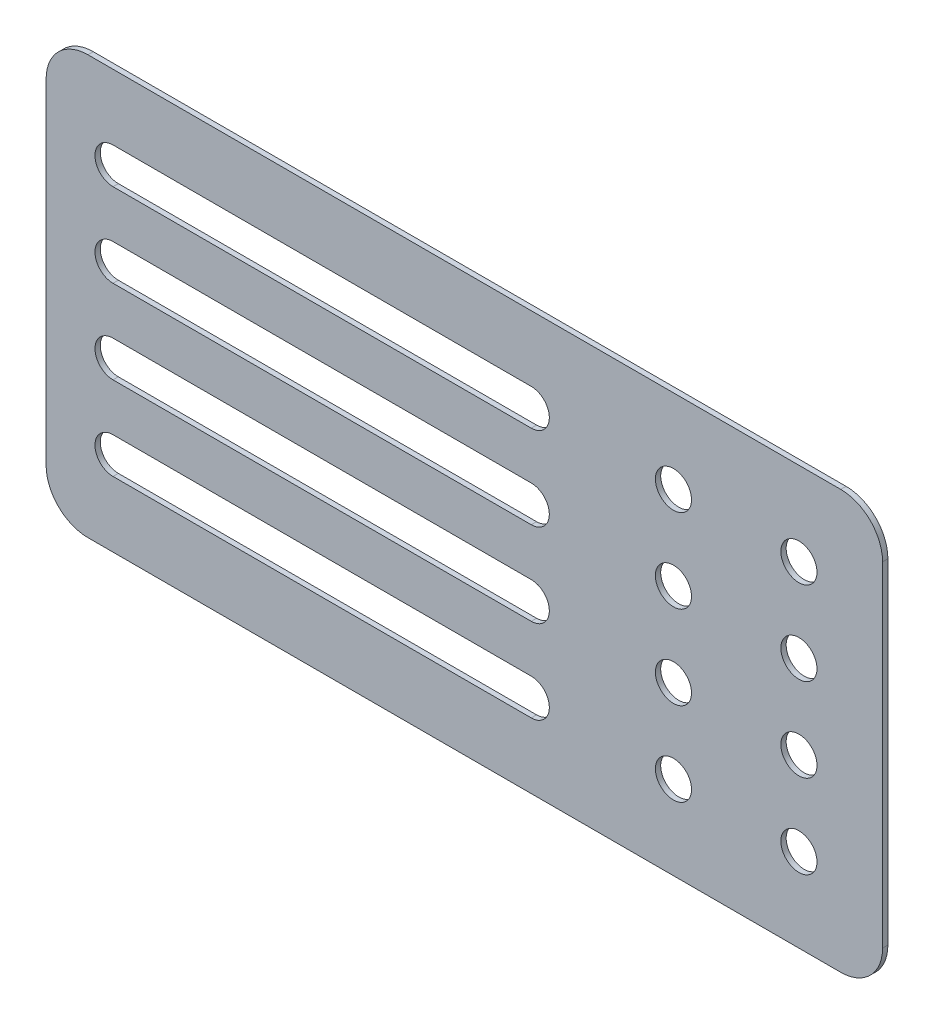
ISO-10303-21;
HEADER;
FILE_DESCRIPTION(('STEP AP214'),'2;1');
FILE_NAME('part.step','',(''),(''),'','','');
FILE_SCHEMA(('AUTOMOTIVE_DESIGN { 1 0 10303 214 1 1 1 1 }'));
ENDSEC;
DATA;
#1=APPLICATION_CONTEXT('core data for automotive mechanical design processes');
#2=APPLICATION_PROTOCOL_DEFINITION('international standard','automotive_design',2000,#1);
#3=PRODUCT_CONTEXT('',#1,'mechanical');
#4=PRODUCT('Part','Part','',(#3));
#5=PRODUCT_RELATED_PRODUCT_CATEGORY('part','',(#4));
#6=PRODUCT_DEFINITION_FORMATION('','',#4);
#7=PRODUCT_DEFINITION_CONTEXT('part definition',#1,'design');
#8=PRODUCT_DEFINITION('design','',#6,#7);
#9=PRODUCT_DEFINITION_SHAPE('','',#8);
#10=(LENGTH_UNIT() NAMED_UNIT(*) SI_UNIT(.MILLI.,.METRE.));
#11=(NAMED_UNIT(*) PLANE_ANGLE_UNIT() SI_UNIT($,.RADIAN.));
#12=(NAMED_UNIT(*) SI_UNIT($,.STERADIAN.) SOLID_ANGLE_UNIT());
#13=UNCERTAINTY_MEASURE_WITH_UNIT(LENGTH_MEASURE(1.E-05),#10,'distance_accuracy_value','');
#14=(GEOMETRIC_REPRESENTATION_CONTEXT(3) GLOBAL_UNCERTAINTY_ASSIGNED_CONTEXT((#13)) GLOBAL_UNIT_ASSIGNED_CONTEXT((#10,
#11,#12)) REPRESENTATION_CONTEXT('',''));
#15=CARTESIAN_POINT('',(0.,0.,0.));
#16=DIRECTION('',(0.,0.,1.));
#17=DIRECTION('',(1.,0.,0.));
#18=AXIS2_PLACEMENT_3D('',#15,#16,#17);
#19=CARTESIAN_POINT('',(0.,0.,0.635));
#20=DIRECTION('',(0.,-1.,0.));
#21=DIRECTION('',(1.,0.,0.));
#22=AXIS2_PLACEMENT_3D('',#19,#20,#21);
#23=PLANE('',#22);
#24=DIRECTION('',(-1.,0.,0.));
#25=VECTOR('',#24,1.);
#26=CARTESIAN_POINT('',(0.,0.,0.635));
#27=LINE('',#26,#25);
#28=CARTESIAN_POINT('',(95.,0.,0.635));
#29=VERTEX_POINT('',#28);
#30=CARTESIAN_POINT('',(5.,0.,0.635));
#31=VERTEX_POINT('',#30);
#32=EDGE_CURVE('E322',#29,#31,#27,.T.);
#33=ORIENTED_EDGE('',*,*,#32,.F.);
#34=DIRECTION('',(0.,0.,-1.));
#35=VECTOR('',#34,1.);
#36=CARTESIAN_POINT('',(95.,0.,0.));
#37=LINE('',#36,#35);
#38=CARTESIAN_POINT('',(95.,0.,0.));
#39=VERTEX_POINT('',#38);
#40=EDGE_CURVE('E11',#29,#39,#37,.T.);
#41=ORIENTED_EDGE('',*,*,#40,.T.);
#42=DIRECTION('',(-1.,0.,0.));
#43=VECTOR('',#42,1.);
#44=CARTESIAN_POINT('',(0.,0.,0.));
#45=LINE('',#44,#43);
#46=CARTESIAN_POINT('',(5.,0.,0.));
#47=VERTEX_POINT('',#46);
#48=EDGE_CURVE('E430',#39,#47,#45,.T.);
#49=ORIENTED_EDGE('',*,*,#48,.T.);
#50=DIRECTION('',(0.,0.,-1.));
#51=VECTOR('',#50,1.);
#52=CARTESIAN_POINT('',(5.,0.,0.635));
#53=LINE('',#52,#51);
#54=EDGE_CURVE('E54',#47,#31,#53,.F.);
#55=ORIENTED_EDGE('',*,*,#54,.T.);
#56=EDGE_LOOP('',(#33,#41,#49,#55));
#57=FACE_BOUND('',#56,.T.);
#58=ADVANCED_FACE('F45',(#57),#23,.F.);
#59=CARTESIAN_POINT('',(0.,0.,0.635));
#60=DIRECTION('',(1.,0.,0.));
#61=DIRECTION('',(0.,1.,0.));
#62=AXIS2_PLACEMENT_3D('',#59,#60,#61);
#63=PLANE('',#62);
#64=DIRECTION('',(0.,-1.,0.));
#65=VECTOR('',#64,1.);
#66=CARTESIAN_POINT('',(0.,0.,0.));
#67=LINE('',#66,#65);
#68=CARTESIAN_POINT('',(0.,-5.,0.));
#69=VERTEX_POINT('',#68);
#70=CARTESIAN_POINT('',(0.,-45.,0.));
#71=VERTEX_POINT('',#70);
#72=EDGE_CURVE('E434',#69,#71,#67,.T.);
#73=ORIENTED_EDGE('',*,*,#72,.T.);
#74=DIRECTION('',(0.,0.,-1.));
#75=VECTOR('',#74,1.);
#76=CARTESIAN_POINT('',(0.,-45.,0.635));
#77=LINE('',#76,#75);
#78=CARTESIAN_POINT('',(0.,-45.,0.635));
#79=VERTEX_POINT('',#78);
#80=EDGE_CURVE('E61',#71,#79,#77,.F.);
#81=ORIENTED_EDGE('',*,*,#80,.T.);
#82=DIRECTION('',(0.,-1.,0.));
#83=VECTOR('',#82,1.);
#84=CARTESIAN_POINT('',(0.,0.,0.635));
#85=LINE('',#84,#83);
#86=CARTESIAN_POINT('',(0.,-5.,0.635));
#87=VERTEX_POINT('',#86);
#88=EDGE_CURVE('E325',#87,#79,#85,.T.);
#89=ORIENTED_EDGE('',*,*,#88,.F.);
#90=DIRECTION('',(0.,0.,-1.));
#91=VECTOR('',#90,1.);
#92=CARTESIAN_POINT('',(0.,-5.,0.635));
#93=LINE('',#92,#91);
#94=EDGE_CURVE('E523',#87,#69,#93,.T.);
#95=ORIENTED_EDGE('',*,*,#94,.T.);
#96=EDGE_LOOP('',(#73,#81,#89,#95));
#97=FACE_BOUND('',#96,.T.);
#98=ADVANCED_FACE('F540',(#97),#63,.F.);
#99=CARTESIAN_POINT('',(0.,-50.,0.635));
#100=DIRECTION('',(0.,-1.,0.));
#101=DIRECTION('',(1.,0.,0.));
#102=AXIS2_PLACEMENT_3D('',#99,#100,#101);
#103=PLANE('',#102);
#104=DIRECTION('',(-1.,0.,0.));
#105=VECTOR('',#104,1.);
#106=CARTESIAN_POINT('',(0.,-50.,0.));
#107=LINE('',#106,#105);
#108=CARTESIAN_POINT('',(95.,-50.,0.));
#109=VERTEX_POINT('',#108);
#110=CARTESIAN_POINT('',(5.00000000000001,-50.,0.));
#111=VERTEX_POINT('',#110);
#112=EDGE_CURVE('E437',#109,#111,#107,.T.);
#113=ORIENTED_EDGE('',*,*,#112,.F.);
#114=DIRECTION('',(0.,0.,-1.));
#115=VECTOR('',#114,1.);
#116=CARTESIAN_POINT('',(95.,-50.,0.635));
#117=LINE('',#116,#115);
#118=CARTESIAN_POINT('',(95.,-50.,0.635));
#119=VERTEX_POINT('',#118);
#120=EDGE_CURVE('E509',#109,#119,#117,.F.);
#121=ORIENTED_EDGE('',*,*,#120,.T.);
#122=DIRECTION('',(-1.,0.,0.));
#123=VECTOR('',#122,1.);
#124=CARTESIAN_POINT('',(0.,-50.,0.635));
#125=LINE('',#124,#123);
#126=CARTESIAN_POINT('',(5.00000000000001,-50.,0.635));
#127=VERTEX_POINT('',#126);
#128=EDGE_CURVE('E328',#119,#127,#125,.T.);
#129=ORIENTED_EDGE('',*,*,#128,.T.);
#130=DIRECTION('',(0.,0.,-1.));
#131=VECTOR('',#130,1.);
#132=CARTESIAN_POINT('',(5.00000000000001,-50.,0.));
#133=LINE('',#132,#131);
#134=EDGE_CURVE('E505',#127,#111,#133,.T.);
#135=ORIENTED_EDGE('',*,*,#134,.T.);
#136=EDGE_LOOP('',(#113,#121,#129,#135));
#137=FACE_BOUND('',#136,.T.);
#138=ADVANCED_FACE('F549',(#137),#103,.T.);
#139=CARTESIAN_POINT('',(58.,-9.99999999999999,0.635));
#140=DIRECTION('',(0.,0.,-1.));
#141=DIRECTION('',(-1.,0.,0.));
#142=AXIS2_PLACEMENT_3D('',#139,#140,#141);
#143=CYLINDRICAL_SURFACE('',#142,2.15999999999961);
#144=CARTESIAN_POINT('',(58.,-9.99999999999999,0.));
#145=DIRECTION('',(0.,0.,1.));
#146=DIRECTION('',(1.,0.,0.));
#147=AXIS2_PLACEMENT_3D('',#144,#145,#146);
#148=CIRCLE('',#147,2.15999999999961);
#149=CARTESIAN_POINT('',(58.,-12.1599999999996,0.));
#150=VERTEX_POINT('',#149);
#151=CARTESIAN_POINT('',(58.,-7.84000000000038,0.));
#152=VERTEX_POINT('',#151);
#153=EDGE_CURVE('E382',#150,#152,#148,.T.);
#154=ORIENTED_EDGE('',*,*,#153,.F.);
#155=DIRECTION('',(0.,0.,-1.));
#156=VECTOR('',#155,1.);
#157=CARTESIAN_POINT('',(58.,-12.1599999999996,0.635));
#158=LINE('',#157,#156);
#159=CARTESIAN_POINT('',(58.,-12.1599999999996,0.635));
#160=VERTEX_POINT('',#159);
#161=EDGE_CURVE('E454',#160,#150,#158,.T.);
#162=ORIENTED_EDGE('',*,*,#161,.F.);
#163=CARTESIAN_POINT('',(58.,-9.99999999999999,0.635));
#164=DIRECTION('',(0.,0.,1.));
#165=DIRECTION('',(1.,0.,0.));
#166=AXIS2_PLACEMENT_3D('',#163,#164,#165);
#167=CIRCLE('',#166,2.15999999999961);
#168=CARTESIAN_POINT('',(58.,-7.84000000000038,0.635));
#169=VERTEX_POINT('',#168);
#170=EDGE_CURVE('E275',#160,#169,#167,.T.);
#171=ORIENTED_EDGE('',*,*,#170,.T.);
#172=DIRECTION('',(0.,0.,-1.));
#173=VECTOR('',#172,1.);
#174=CARTESIAN_POINT('',(58.,-7.84000000000038,0.635));
#175=LINE('',#174,#173);
#176=EDGE_CURVE('E444',#169,#152,#175,.T.);
#177=ORIENTED_EDGE('',*,*,#176,.T.);
#178=EDGE_LOOP('',(#154,#162,#171,#177));
#179=FACE_BOUND('',#178,.T.);
#180=ADVANCED_FACE('F621',(#179),#143,.F.);
#181=CARTESIAN_POINT('',(0.,-12.1599999999996,0.635));
#182=DIRECTION('',(0.,1.,0.));
#183=DIRECTION('',(-1.,0.,0.));
#184=AXIS2_PLACEMENT_3D('',#181,#182,#183);
#185=PLANE('',#184);
#186=DIRECTION('',(1.,0.,0.));
#187=VECTOR('',#186,1.);
#188=CARTESIAN_POINT('',(0.,-12.1599999999996,0.));
#189=LINE('',#188,#187);
#190=CARTESIAN_POINT('',(7.99999999999999,-12.1599999999996,0.));
#191=VERTEX_POINT('',#190);
#192=EDGE_CURVE('E386',#191,#150,#189,.T.);
#193=ORIENTED_EDGE('',*,*,#192,.F.);
#194=DIRECTION('',(0.,0.,-1.));
#195=VECTOR('',#194,1.);
#196=CARTESIAN_POINT('',(7.99999999999999,-12.1599999999996,0.635));
#197=LINE('',#196,#195);
#198=CARTESIAN_POINT('',(7.99999999999999,-12.1599999999996,0.635));
#199=VERTEX_POINT('',#198);
#200=EDGE_CURVE('E451',#199,#191,#197,.T.);
#201=ORIENTED_EDGE('',*,*,#200,.F.);
#202=DIRECTION('',(1.,0.,0.));
#203=VECTOR('',#202,1.);
#204=CARTESIAN_POINT('',(0.,-12.1599999999996,0.635));
#205=LINE('',#204,#203);
#206=EDGE_CURVE('E279',#199,#160,#205,.T.);
#207=ORIENTED_EDGE('',*,*,#206,.T.);
#208=ORIENTED_EDGE('',*,*,#161,.T.);
#209=EDGE_LOOP('',(#193,#201,#207,#208));
#210=FACE_BOUND('',#209,.T.);
#211=ADVANCED_FACE('F617',(#210),#185,.T.);
#212=CARTESIAN_POINT('',(7.99999999999999,-10.,0.635));
#213=DIRECTION('',(0.,0.,-1.));
#214=DIRECTION('',(-1.,0.,0.));
#215=AXIS2_PLACEMENT_3D('',#212,#213,#214);
#216=CYLINDRICAL_SURFACE('',#215,2.15999999999961);
#217=CARTESIAN_POINT('',(7.99999999999999,-10.,0.));
#218=DIRECTION('',(0.,0.,1.));
#219=DIRECTION('',(1.,0.,0.));
#220=AXIS2_PLACEMENT_3D('',#217,#218,#219);
#221=CIRCLE('',#220,2.15999999999961);
#222=CARTESIAN_POINT('',(7.99999999999999,-7.84000000000039,0.));
#223=VERTEX_POINT('',#222);
#224=EDGE_CURVE('E390',#223,#191,#221,.T.);
#225=ORIENTED_EDGE('',*,*,#224,.F.);
#226=DIRECTION('',(0.,0.,-1.));
#227=VECTOR('',#226,1.);
#228=CARTESIAN_POINT('',(7.99999999999999,-7.84000000000039,0.635));
#229=LINE('',#228,#227);
#230=CARTESIAN_POINT('',(7.99999999999999,-7.84000000000039,0.635));
#231=VERTEX_POINT('',#230);
#232=EDGE_CURVE('E447',#231,#223,#229,.T.);
#233=ORIENTED_EDGE('',*,*,#232,.F.);
#234=CARTESIAN_POINT('',(7.99999999999999,-10.,0.635));
#235=DIRECTION('',(0.,0.,1.));
#236=DIRECTION('',(1.,0.,0.));
#237=AXIS2_PLACEMENT_3D('',#234,#235,#236);
#238=CIRCLE('',#237,2.15999999999961);
#239=EDGE_CURVE('E283',#231,#199,#238,.T.);
#240=ORIENTED_EDGE('',*,*,#239,.T.);
#241=ORIENTED_EDGE('',*,*,#200,.T.);
#242=EDGE_LOOP('',(#225,#233,#240,#241));
#243=FACE_BOUND('',#242,.T.);
#244=ADVANCED_FACE('F613',(#243),#216,.F.);
#245=CARTESIAN_POINT('',(58.0000000000001,-20.,0.635));
#246=DIRECTION('',(0.,0.,-1.));
#247=DIRECTION('',(-1.,0.,0.));
#248=AXIS2_PLACEMENT_3D('',#245,#246,#247);
#249=CYLINDRICAL_SURFACE('',#248,2.15999999999961);
#250=CARTESIAN_POINT('',(58.0000000000001,-20.,0.));
#251=DIRECTION('',(0.,0.,1.));
#252=DIRECTION('',(1.,0.,0.));
#253=AXIS2_PLACEMENT_3D('',#250,#251,#252);
#254=CIRCLE('',#253,2.15999999999961);
#255=CARTESIAN_POINT('',(58.0000000000001,-22.1599999999996,0.));
#256=VERTEX_POINT('',#255);
#257=CARTESIAN_POINT('',(58.0000000000001,-17.8400000000004,0.));
#258=VERTEX_POINT('',#257);
#259=EDGE_CURVE('E366',#256,#258,#254,.T.);
#260=ORIENTED_EDGE('',*,*,#259,.F.);
#261=DIRECTION('',(0.,0.,-1.));
#262=VECTOR('',#261,1.);
#263=CARTESIAN_POINT('',(58.0000000000001,-22.1599999999996,0.635));
#264=LINE('',#263,#262);
#265=CARTESIAN_POINT('',(58.0000000000001,-22.1599999999996,0.635));
#266=VERTEX_POINT('',#265);
#267=EDGE_CURVE('E448',#266,#256,#264,.T.);
#268=ORIENTED_EDGE('',*,*,#267,.F.);
#269=CARTESIAN_POINT('',(58.0000000000001,-20.,0.635));
#270=DIRECTION('',(0.,0.,1.));
#271=DIRECTION('',(1.,0.,0.));
#272=AXIS2_PLACEMENT_3D('',#269,#270,#271);
#273=CIRCLE('',#272,2.15999999999961);
#274=CARTESIAN_POINT('',(58.0000000000001,-17.8400000000004,0.635));
#275=VERTEX_POINT('',#274);
#276=EDGE_CURVE('E260',#266,#275,#273,.T.);
#277=ORIENTED_EDGE('',*,*,#276,.T.);
#278=DIRECTION('',(0.,0.,-1.));
#279=VECTOR('',#278,1.);
#280=CARTESIAN_POINT('',(58.0000000000001,-17.8400000000004,0.635));
#281=LINE('',#280,#279);
#282=EDGE_CURVE('E458',#275,#258,#281,.T.);
#283=ORIENTED_EDGE('',*,*,#282,.T.);
#284=EDGE_LOOP('',(#260,#268,#277,#283));
#285=FACE_BOUND('',#284,.T.);
#286=ADVANCED_FACE('F616',(#285),#249,.F.);
#287=CARTESIAN_POINT('',(0.,-22.1599999999996,0.635));
#288=DIRECTION('',(0.,1.,0.));
#289=DIRECTION('',(-1.,0.,0.));
#290=AXIS2_PLACEMENT_3D('',#287,#288,#289);
#291=PLANE('',#290);
#292=DIRECTION('',(1.,0.,0.));
#293=VECTOR('',#292,1.);
#294=CARTESIAN_POINT('',(0.,-22.1599999999996,0.));
#295=LINE('',#294,#293);
#296=CARTESIAN_POINT('',(8.0000000000001,-22.1599999999996,0.));
#297=VERTEX_POINT('',#296);
#298=EDGE_CURVE('E370',#297,#256,#295,.T.);
#299=ORIENTED_EDGE('',*,*,#298,.F.);
#300=DIRECTION('',(0.,0.,-1.));
#301=VECTOR('',#300,1.);
#302=CARTESIAN_POINT('',(8.0000000000001,-22.1599999999996,0.635));
#303=LINE('',#302,#301);
#304=CARTESIAN_POINT('',(8.0000000000001,-22.1599999999996,0.635));
#305=VERTEX_POINT('',#304);
#306=EDGE_CURVE('E465',#305,#297,#303,.T.);
#307=ORIENTED_EDGE('',*,*,#306,.F.);
#308=DIRECTION('',(1.,0.,0.));
#309=VECTOR('',#308,1.);
#310=CARTESIAN_POINT('',(0.,-22.1599999999996,0.635));
#311=LINE('',#310,#309);
#312=EDGE_CURVE('E264',#305,#266,#311,.T.);
#313=ORIENTED_EDGE('',*,*,#312,.T.);
#314=ORIENTED_EDGE('',*,*,#267,.T.);
#315=EDGE_LOOP('',(#299,#307,#313,#314));
#316=FACE_BOUND('',#315,.T.);
#317=ADVANCED_FACE('F634',(#316),#291,.T.);
#318=CARTESIAN_POINT('',(8.0000000000001,-20.,0.635));
#319=DIRECTION('',(0.,0.,-1.));
#320=DIRECTION('',(-1.,0.,0.));
#321=AXIS2_PLACEMENT_3D('',#318,#319,#320);
#322=CYLINDRICAL_SURFACE('',#321,2.15999999999961);
#323=CARTESIAN_POINT('',(8.0000000000001,-20.,0.));
#324=DIRECTION('',(0.,0.,1.));
#325=DIRECTION('',(1.,0.,0.));
#326=AXIS2_PLACEMENT_3D('',#323,#324,#325);
#327=CIRCLE('',#326,2.15999999999961);
#328=CARTESIAN_POINT('',(8.0000000000001,-17.8400000000004,0.));
#329=VERTEX_POINT('',#328);
#330=EDGE_CURVE('E374',#329,#297,#327,.T.);
#331=ORIENTED_EDGE('',*,*,#330,.F.);
#332=DIRECTION('',(0.,0.,-1.));
#333=VECTOR('',#332,1.);
#334=CARTESIAN_POINT('',(8.0000000000001,-17.8400000000004,0.635));
#335=LINE('',#334,#333);
#336=CARTESIAN_POINT('',(8.0000000000001,-17.8400000000004,0.635));
#337=VERTEX_POINT('',#336);
#338=EDGE_CURVE('E461',#337,#329,#335,.T.);
#339=ORIENTED_EDGE('',*,*,#338,.F.);
#340=CARTESIAN_POINT('',(8.0000000000001,-20.,0.635));
#341=DIRECTION('',(0.,0.,1.));
#342=DIRECTION('',(1.,0.,0.));
#343=AXIS2_PLACEMENT_3D('',#340,#341,#342);
#344=CIRCLE('',#343,2.15999999999961);
#345=EDGE_CURVE('E268',#337,#305,#344,.T.);
#346=ORIENTED_EDGE('',*,*,#345,.T.);
#347=ORIENTED_EDGE('',*,*,#306,.T.);
#348=EDGE_LOOP('',(#331,#339,#346,#347));
#349=FACE_BOUND('',#348,.T.);
#350=ADVANCED_FACE('F630',(#349),#322,.F.);
#351=CARTESIAN_POINT('',(58.0000000000002,-30.,0.635));
#352=DIRECTION('',(0.,0.,-1.));
#353=DIRECTION('',(-1.,0.,0.));
#354=AXIS2_PLACEMENT_3D('',#351,#352,#353);
#355=CYLINDRICAL_SURFACE('',#354,2.1599999999996);
#356=CARTESIAN_POINT('',(58.0000000000002,-30.,0.));
#357=DIRECTION('',(0.,0.,1.));
#358=DIRECTION('',(1.,0.,0.));
#359=AXIS2_PLACEMENT_3D('',#356,#357,#358);
#360=CIRCLE('',#359,2.1599999999996);
#361=CARTESIAN_POINT('',(58.0000000000002,-32.1599999999996,0.));
#362=VERTEX_POINT('',#361);
#363=CARTESIAN_POINT('',(58.0000000000002,-27.8400000000004,0.));
#364=VERTEX_POINT('',#363);
#365=EDGE_CURVE('E350',#362,#364,#360,.T.);
#366=ORIENTED_EDGE('',*,*,#365,.F.);
#367=DIRECTION('',(0.,0.,-1.));
#368=VECTOR('',#367,1.);
#369=CARTESIAN_POINT('',(58.0000000000002,-32.1599999999996,0.635));
#370=LINE('',#369,#368);
#371=CARTESIAN_POINT('',(58.0000000000002,-32.1599999999996,0.635));
#372=VERTEX_POINT('',#371);
#373=EDGE_CURVE('E462',#372,#362,#370,.T.);
#374=ORIENTED_EDGE('',*,*,#373,.F.);
#375=CARTESIAN_POINT('',(58.0000000000002,-30.,0.635));
#376=DIRECTION('',(0.,0.,1.));
#377=DIRECTION('',(1.,0.,0.));
#378=AXIS2_PLACEMENT_3D('',#375,#376,#377);
#379=CIRCLE('',#378,2.1599999999996);
#380=CARTESIAN_POINT('',(58.0000000000002,-27.8400000000004,0.635));
#381=VERTEX_POINT('',#380);
#382=EDGE_CURVE('E245',#372,#381,#379,.T.);
#383=ORIENTED_EDGE('',*,*,#382,.T.);
#384=DIRECTION('',(0.,0.,-1.));
#385=VECTOR('',#384,1.);
#386=CARTESIAN_POINT('',(58.0000000000002,-27.8400000000004,0.635));
#387=LINE('',#386,#385);
#388=EDGE_CURVE('E220',#381,#364,#387,.T.);
#389=ORIENTED_EDGE('',*,*,#388,.T.);
#390=EDGE_LOOP('',(#366,#374,#383,#389));
#391=FACE_BOUND('',#390,.T.);
#392=ADVANCED_FACE('F633',(#391),#355,.F.);
#393=CARTESIAN_POINT('',(0.,-32.1599999999996,0.635));
#394=DIRECTION('',(0.,1.,0.));
#395=DIRECTION('',(-1.,0.,0.));
#396=AXIS2_PLACEMENT_3D('',#393,#394,#395);
#397=PLANE('',#396);
#398=DIRECTION('',(1.,0.,0.));
#399=VECTOR('',#398,1.);
#400=CARTESIAN_POINT('',(0.,-32.1599999999996,0.));
#401=LINE('',#400,#399);
#402=CARTESIAN_POINT('',(8.0000000000002,-32.1599999999996,0.));
#403=VERTEX_POINT('',#402);
#404=EDGE_CURVE('E354',#403,#362,#401,.T.);
#405=ORIENTED_EDGE('',*,*,#404,.F.);
#406=DIRECTION('',(0.,0.,-1.));
#407=VECTOR('',#406,1.);
#408=CARTESIAN_POINT('',(8.0000000000002,-32.1599999999996,0.635));
#409=LINE('',#408,#407);
#410=CARTESIAN_POINT('',(8.0000000000002,-32.1599999999996,0.635));
#411=VERTEX_POINT('',#410);
#412=EDGE_CURVE('E475',#411,#403,#409,.T.);
#413=ORIENTED_EDGE('',*,*,#412,.F.);
#414=DIRECTION('',(1.,0.,0.));
#415=VECTOR('',#414,1.);
#416=CARTESIAN_POINT('',(0.,-32.1599999999996,0.635));
#417=LINE('',#416,#415);
#418=EDGE_CURVE('E249',#411,#372,#417,.T.);
#419=ORIENTED_EDGE('',*,*,#418,.T.);
#420=ORIENTED_EDGE('',*,*,#373,.T.);
#421=EDGE_LOOP('',(#405,#413,#419,#420));
#422=FACE_BOUND('',#421,.T.);
#423=ADVANCED_FACE('F649',(#422),#397,.T.);
#424=CARTESIAN_POINT('',(8.0000000000002,-30.,0.635));
#425=DIRECTION('',(0.,0.,-1.));
#426=DIRECTION('',(-1.,0.,0.));
#427=AXIS2_PLACEMENT_3D('',#424,#425,#426);
#428=CYLINDRICAL_SURFACE('',#427,2.15999999999961);
#429=CARTESIAN_POINT('',(8.0000000000002,-30.,0.));
#430=DIRECTION('',(0.,0.,1.));
#431=DIRECTION('',(1.,0.,0.));
#432=AXIS2_PLACEMENT_3D('',#429,#430,#431);
#433=CIRCLE('',#432,2.15999999999961);
#434=CARTESIAN_POINT('',(8.0000000000002,-27.8400000000004,0.));
#435=VERTEX_POINT('',#434);
#436=EDGE_CURVE('E358',#435,#403,#433,.T.);
#437=ORIENTED_EDGE('',*,*,#436,.F.);
#438=DIRECTION('',(0.,0.,-1.));
#439=VECTOR('',#438,1.);
#440=CARTESIAN_POINT('',(8.0000000000002,-27.8400000000004,0.635));
#441=LINE('',#440,#439);
#442=CARTESIAN_POINT('',(8.0000000000002,-27.8400000000004,0.635));
#443=VERTEX_POINT('',#442);
#444=EDGE_CURVE('E472',#443,#435,#441,.T.);
#445=ORIENTED_EDGE('',*,*,#444,.F.);
#446=CARTESIAN_POINT('',(8.0000000000002,-30.,0.635));
#447=DIRECTION('',(0.,0.,1.));
#448=DIRECTION('',(1.,0.,0.));
#449=AXIS2_PLACEMENT_3D('',#446,#447,#448);
#450=CIRCLE('',#449,2.15999999999961);
#451=EDGE_CURVE('E253',#443,#411,#450,.T.);
#452=ORIENTED_EDGE('',*,*,#451,.T.);
#453=ORIENTED_EDGE('',*,*,#412,.T.);
#454=EDGE_LOOP('',(#437,#445,#452,#453));
#455=FACE_BOUND('',#454,.T.);
#456=ADVANCED_FACE('F646',(#455),#428,.F.);
#457=CARTESIAN_POINT('',(58.0000000000003,-40.,0.635));
#458=DIRECTION('',(0.,0.,-1.));
#459=DIRECTION('',(-1.,0.,0.));
#460=AXIS2_PLACEMENT_3D('',#457,#458,#459);
#461=CYLINDRICAL_SURFACE('',#460,2.15999999999961);
#462=CARTESIAN_POINT('',(58.0000000000003,-40.,0.));
#463=DIRECTION('',(0.,0.,1.));
#464=DIRECTION('',(1.,0.,0.));
#465=AXIS2_PLACEMENT_3D('',#462,#463,#464);
#466=CIRCLE('',#465,2.15999999999961);
#467=CARTESIAN_POINT('',(58.0000000000003,-42.1599999999996,0.));
#468=VERTEX_POINT('',#467);
#469=CARTESIAN_POINT('',(58.0000000000003,-37.8400000000004,0.));
#470=VERTEX_POINT('',#469);
#471=EDGE_CURVE('E214',#468,#470,#466,.T.);
#472=ORIENTED_EDGE('',*,*,#471,.F.);
#473=DIRECTION('',(0.,0.,-1.));
#474=VECTOR('',#473,1.);
#475=CARTESIAN_POINT('',(58.0000000000003,-42.1599999999996,0.635));
#476=LINE('',#475,#474);
#477=CARTESIAN_POINT('',(58.0000000000003,-42.1599999999996,0.635));
#478=VERTEX_POINT('',#477);
#479=EDGE_CURVE('E209',#478,#468,#476,.T.);
#480=ORIENTED_EDGE('',*,*,#479,.F.);
#481=CARTESIAN_POINT('',(58.0000000000003,-40.,0.635));
#482=DIRECTION('',(0.,0.,1.));
#483=DIRECTION('',(1.,0.,0.));
#484=AXIS2_PLACEMENT_3D('',#481,#482,#483);
#485=CIRCLE('',#484,2.15999999999961);
#486=CARTESIAN_POINT('',(58.0000000000003,-37.8400000000004,0.635));
#487=VERTEX_POINT('',#486);
#488=EDGE_CURVE('E212',#478,#487,#485,.T.);
#489=ORIENTED_EDGE('',*,*,#488,.T.);
#490=DIRECTION('',(0.,0.,-1.));
#491=VECTOR('',#490,1.);
#492=CARTESIAN_POINT('',(58.0000000000003,-37.8400000000004,0.635));
#493=LINE('',#492,#491);
#494=EDGE_CURVE('E336',#487,#470,#493,.T.);
#495=ORIENTED_EDGE('',*,*,#494,.T.);
#496=EDGE_LOOP('',(#472,#480,#489,#495));
#497=FACE_BOUND('',#496,.T.);
#498=ADVANCED_FACE('F211',(#497),#461,.F.);
#499=CARTESIAN_POINT('',(0.,-42.1599999999996,0.635));
#500=DIRECTION('',(0.,1.,0.));
#501=DIRECTION('',(-1.,0.,0.));
#502=AXIS2_PLACEMENT_3D('',#499,#500,#501);
#503=PLANE('',#502);
#504=DIRECTION('',(1.,0.,0.));
#505=VECTOR('',#504,1.);
#506=CARTESIAN_POINT('',(0.,-42.1599999999996,0.));
#507=LINE('',#506,#505);
#508=CARTESIAN_POINT('',(8.00000000000031,-42.1599999999996,0.));
#509=VERTEX_POINT('',#508);
#510=EDGE_CURVE('E339',#509,#468,#507,.T.);
#511=ORIENTED_EDGE('',*,*,#510,.F.);
#512=DIRECTION('',(0.,0.,-1.));
#513=VECTOR('',#512,1.);
#514=CARTESIAN_POINT('',(8.00000000000031,-42.1599999999996,0.635));
#515=LINE('',#514,#513);
#516=CARTESIAN_POINT('',(8.00000000000031,-42.1599999999996,0.635));
#517=VERTEX_POINT('',#516);
#518=EDGE_CURVE('E221',#517,#509,#515,.T.);
#519=ORIENTED_EDGE('',*,*,#518,.F.);
#520=DIRECTION('',(1.,0.,0.));
#521=VECTOR('',#520,1.);
#522=CARTESIAN_POINT('',(0.,-42.1599999999996,0.635));
#523=LINE('',#522,#521);
#524=EDGE_CURVE('E228',#517,#478,#523,.T.);
#525=ORIENTED_EDGE('',*,*,#524,.T.);
#526=ORIENTED_EDGE('',*,*,#479,.T.);
#527=EDGE_LOOP('',(#511,#519,#525,#526));
#528=FACE_BOUND('',#527,.T.);
#529=ADVANCED_FACE('F236',(#528),#503,.T.);
#530=CARTESIAN_POINT('',(8.00000000000031,-40.,0.635));
#531=DIRECTION('',(0.,0.,-1.));
#532=DIRECTION('',(-1.,0.,0.));
#533=AXIS2_PLACEMENT_3D('',#530,#531,#532);
#534=CYLINDRICAL_SURFACE('',#533,2.15999999999961);
#535=CARTESIAN_POINT('',(8.00000000000031,-40.,0.));
#536=DIRECTION('',(0.,0.,1.));
#537=DIRECTION('',(1.,0.,0.));
#538=AXIS2_PLACEMENT_3D('',#535,#536,#537);
#539=CIRCLE('',#538,2.15999999999961);
#540=CARTESIAN_POINT('',(8.00000000000031,-37.8400000000004,0.));
#541=VERTEX_POINT('',#540);
#542=EDGE_CURVE('E342',#541,#509,#539,.T.);
#543=ORIENTED_EDGE('',*,*,#542,.F.);
#544=DIRECTION('',(0.,0.,-1.));
#545=VECTOR('',#544,1.);
#546=CARTESIAN_POINT('',(8.00000000000031,-37.8400000000004,0.635));
#547=LINE('',#546,#545);
#548=CARTESIAN_POINT('',(8.00000000000031,-37.8400000000004,0.635));
#549=VERTEX_POINT('',#548);
#550=EDGE_CURVE('E482',#549,#541,#547,.T.);
#551=ORIENTED_EDGE('',*,*,#550,.F.);
#552=CARTESIAN_POINT('',(8.00000000000031,-40.,0.635));
#553=DIRECTION('',(0.,0.,1.));
#554=DIRECTION('',(1.,0.,0.));
#555=AXIS2_PLACEMENT_3D('',#552,#553,#554);
#556=CIRCLE('',#555,2.15999999999961);
#557=EDGE_CURVE('E238',#549,#517,#556,.T.);
#558=ORIENTED_EDGE('',*,*,#557,.T.);
#559=ORIENTED_EDGE('',*,*,#518,.T.);
#560=EDGE_LOOP('',(#543,#551,#558,#559));
#561=FACE_BOUND('',#560,.T.);
#562=ADVANCED_FACE('F579',(#561),#534,.F.);
#563=CARTESIAN_POINT('',(75.,-10.,0.635));
#564=DIRECTION('',(0.,0.,-1.));
#565=DIRECTION('',(-1.,0.,0.));
#566=AXIS2_PLACEMENT_3D('',#563,#564,#565);
#567=CYLINDRICAL_SURFACE('',#566,2.15999999999961);
#568=CARTESIAN_POINT('',(75.,-10.,0.635));
#569=DIRECTION('',(0.,0.,1.));
#570=DIRECTION('',(1.,0.,0.));
#571=AXIS2_PLACEMENT_3D('',#568,#569,#570);
#572=CIRCLE('',#571,2.15999999999961);
#573=CARTESIAN_POINT('',(77.1599999999996,-10.,0.635));
#574=VERTEX_POINT('',#573);
#575=EDGE_CURVE('E318',#574,#574,#572,.T.);
#576=ORIENTED_EDGE('',*,*,#575,.T.);
#577=EDGE_LOOP('',(#576));
#578=FACE_BOUND('',#577,.T.);
#579=CARTESIAN_POINT('',(75.,-10.,0.));
#580=DIRECTION('',(0.,0.,1.));
#581=DIRECTION('',(1.,0.,0.));
#582=AXIS2_PLACEMENT_3D('',#579,#580,#581);
#583=CIRCLE('',#582,2.15999999999961);
#584=CARTESIAN_POINT('',(77.1599999999996,-10.,0.));
#585=VERTEX_POINT('',#584);
#586=EDGE_CURVE('E426',#585,#585,#583,.T.);
#587=ORIENTED_EDGE('',*,*,#586,.F.);
#588=EDGE_LOOP('',(#587));
#589=FACE_BOUND('',#588,.T.);
#590=ADVANCED_FACE('F575',(#578,#589),#567,.F.);
#591=CARTESIAN_POINT('',(90.,-10.,0.635));
#592=DIRECTION('',(0.,0.,-1.));
#593=DIRECTION('',(-1.,0.,0.));
#594=AXIS2_PLACEMENT_3D('',#591,#592,#593);
#595=CYLINDRICAL_SURFACE('',#594,2.15999999999961);
#596=CARTESIAN_POINT('',(90.,-10.,0.635));
#597=DIRECTION('',(0.,0.,1.));
#598=DIRECTION('',(1.,0.,0.));
#599=AXIS2_PLACEMENT_3D('',#596,#597,#598);
#600=CIRCLE('',#599,2.15999999999961);
#601=CARTESIAN_POINT('',(92.1599999999996,-10.,0.635));
#602=VERTEX_POINT('',#601);
#603=EDGE_CURVE('E314',#602,#602,#600,.T.);
#604=ORIENTED_EDGE('',*,*,#603,.T.);
#605=EDGE_LOOP('',(#604));
#606=FACE_BOUND('',#605,.T.);
#607=CARTESIAN_POINT('',(90.,-10.,0.));
#608=DIRECTION('',(0.,0.,1.));
#609=DIRECTION('',(1.,0.,0.));
#610=AXIS2_PLACEMENT_3D('',#607,#608,#609);
#611=CIRCLE('',#610,2.15999999999961);
#612=CARTESIAN_POINT('',(92.1599999999996,-10.,0.));
#613=VERTEX_POINT('',#612);
#614=EDGE_CURVE('E422',#613,#613,#611,.T.);
#615=ORIENTED_EDGE('',*,*,#614,.F.);
#616=EDGE_LOOP('',(#615));
#617=FACE_BOUND('',#616,.T.);
#618=ADVANCED_FACE('F578',(#606,#617),#595,.F.);
#619=CARTESIAN_POINT('',(75.0000000000001,-20.,0.635));
#620=DIRECTION('',(0.,0.,-1.));
#621=DIRECTION('',(-1.,0.,0.));
#622=AXIS2_PLACEMENT_3D('',#619,#620,#621);
#623=CYLINDRICAL_SURFACE('',#622,2.15999999999961);
#624=CARTESIAN_POINT('',(75.0000000000001,-20.,0.635));
#625=DIRECTION('',(0.,0.,1.));
#626=DIRECTION('',(1.,0.,0.));
#627=AXIS2_PLACEMENT_3D('',#624,#625,#626);
#628=CIRCLE('',#627,2.15999999999961);
#629=CARTESIAN_POINT('',(77.1599999999997,-20.,0.635));
#630=VERTEX_POINT('',#629);
#631=EDGE_CURVE('E310',#630,#630,#628,.T.);
#632=ORIENTED_EDGE('',*,*,#631,.T.);
#633=EDGE_LOOP('',(#632));
#634=FACE_BOUND('',#633,.T.);
#635=CARTESIAN_POINT('',(75.0000000000001,-20.,0.));
#636=DIRECTION('',(0.,0.,1.));
#637=DIRECTION('',(1.,0.,0.));
#638=AXIS2_PLACEMENT_3D('',#635,#636,#637);
#639=CIRCLE('',#638,2.15999999999961);
#640=CARTESIAN_POINT('',(77.1599999999997,-20.,0.));
#641=VERTEX_POINT('',#640);
#642=EDGE_CURVE('E418',#641,#641,#639,.T.);
#643=ORIENTED_EDGE('',*,*,#642,.F.);
#644=EDGE_LOOP('',(#643));
#645=FACE_BOUND('',#644,.T.);
#646=ADVANCED_FACE('F583',(#634,#645),#623,.F.);
#647=CARTESIAN_POINT('',(90.0000000000001,-20.,0.635));
#648=DIRECTION('',(0.,0.,-1.));
#649=DIRECTION('',(-1.,0.,0.));
#650=AXIS2_PLACEMENT_3D('',#647,#648,#649);
#651=CYLINDRICAL_SURFACE('',#650,2.15999999999961);
#652=CARTESIAN_POINT('',(90.0000000000001,-20.,0.635));
#653=DIRECTION('',(0.,0.,1.));
#654=DIRECTION('',(1.,0.,0.));
#655=AXIS2_PLACEMENT_3D('',#652,#653,#654);
#656=CIRCLE('',#655,2.15999999999961);
#657=CARTESIAN_POINT('',(92.1599999999997,-20.,0.635));
#658=VERTEX_POINT('',#657);
#659=EDGE_CURVE('E306',#658,#658,#656,.T.);
#660=ORIENTED_EDGE('',*,*,#659,.T.);
#661=EDGE_LOOP('',(#660));
#662=FACE_BOUND('',#661,.T.);
#663=CARTESIAN_POINT('',(90.0000000000001,-20.,0.));
#664=DIRECTION('',(0.,0.,1.));
#665=DIRECTION('',(1.,0.,0.));
#666=AXIS2_PLACEMENT_3D('',#663,#664,#665);
#667=CIRCLE('',#666,2.15999999999961);
#668=CARTESIAN_POINT('',(92.1599999999997,-20.,0.));
#669=VERTEX_POINT('',#668);
#670=EDGE_CURVE('E414',#669,#669,#667,.T.);
#671=ORIENTED_EDGE('',*,*,#670,.F.);
#672=EDGE_LOOP('',(#671));
#673=FACE_BOUND('',#672,.T.);
#674=ADVANCED_FACE('F587',(#662,#673),#651,.F.);
#675=CARTESIAN_POINT('',(75.0000000000002,-30.,0.635));
#676=DIRECTION('',(0.,0.,-1.));
#677=DIRECTION('',(-1.,0.,0.));
#678=AXIS2_PLACEMENT_3D('',#675,#676,#677);
#679=CYLINDRICAL_SURFACE('',#678,2.15999999999961);
#680=CARTESIAN_POINT('',(75.0000000000002,-30.,0.635));
#681=DIRECTION('',(0.,0.,1.));
#682=DIRECTION('',(1.,0.,0.));
#683=AXIS2_PLACEMENT_3D('',#680,#681,#682);
#684=CIRCLE('',#683,2.15999999999961);
#685=CARTESIAN_POINT('',(77.1599999999998,-30.,0.635));
#686=VERTEX_POINT('',#685);
#687=EDGE_CURVE('E302',#686,#686,#684,.T.);
#688=ORIENTED_EDGE('',*,*,#687,.T.);
#689=EDGE_LOOP('',(#688));
#690=FACE_BOUND('',#689,.T.);
#691=CARTESIAN_POINT('',(75.0000000000002,-30.,0.));
#692=DIRECTION('',(0.,0.,1.));
#693=DIRECTION('',(1.,0.,0.));
#694=AXIS2_PLACEMENT_3D('',#691,#692,#693);
#695=CIRCLE('',#694,2.15999999999961);
#696=CARTESIAN_POINT('',(77.1599999999998,-30.,0.));
#697=VERTEX_POINT('',#696);
#698=EDGE_CURVE('E410',#697,#697,#695,.T.);
#699=ORIENTED_EDGE('',*,*,#698,.F.);
#700=EDGE_LOOP('',(#699));
#701=FACE_BOUND('',#700,.T.);
#702=ADVANCED_FACE('F591',(#690,#701),#679,.F.);
#703=CARTESIAN_POINT('',(90.0000000000002,-30.,0.635));
#704=DIRECTION('',(0.,0.,-1.));
#705=DIRECTION('',(-1.,0.,0.));
#706=AXIS2_PLACEMENT_3D('',#703,#704,#705);
#707=CYLINDRICAL_SURFACE('',#706,2.15999999999961);
#708=CARTESIAN_POINT('',(90.0000000000002,-30.,0.635));
#709=DIRECTION('',(0.,0.,1.));
#710=DIRECTION('',(1.,0.,0.));
#711=AXIS2_PLACEMENT_3D('',#708,#709,#710);
#712=CIRCLE('',#711,2.15999999999961);
#713=CARTESIAN_POINT('',(92.1599999999998,-30.,0.635));
#714=VERTEX_POINT('',#713);
#715=EDGE_CURVE('E298',#714,#714,#712,.T.);
#716=ORIENTED_EDGE('',*,*,#715,.T.);
#717=EDGE_LOOP('',(#716));
#718=FACE_BOUND('',#717,.T.);
#719=CARTESIAN_POINT('',(90.0000000000002,-30.,0.));
#720=DIRECTION('',(0.,0.,1.));
#721=DIRECTION('',(1.,0.,0.));
#722=AXIS2_PLACEMENT_3D('',#719,#720,#721);
#723=CIRCLE('',#722,2.15999999999961);
#724=CARTESIAN_POINT('',(92.1599999999998,-30.,0.));
#725=VERTEX_POINT('',#724);
#726=EDGE_CURVE('E406',#725,#725,#723,.T.);
#727=ORIENTED_EDGE('',*,*,#726,.F.);
#728=EDGE_LOOP('',(#727));
#729=FACE_BOUND('',#728,.T.);
#730=ADVANCED_FACE('F595',(#718,#729),#707,.F.);
#731=CARTESIAN_POINT('',(75.0000000000003,-40.,0.635));
#732=DIRECTION('',(0.,0.,-1.));
#733=DIRECTION('',(-1.,0.,0.));
#734=AXIS2_PLACEMENT_3D('',#731,#732,#733);
#735=CYLINDRICAL_SURFACE('',#734,2.15999999999961);
#736=CARTESIAN_POINT('',(75.0000000000003,-40.,0.635));
#737=DIRECTION('',(0.,0.,1.));
#738=DIRECTION('',(1.,0.,0.));
#739=AXIS2_PLACEMENT_3D('',#736,#737,#738);
#740=CIRCLE('',#739,2.15999999999961);
#741=CARTESIAN_POINT('',(77.1599999999999,-40.,0.635));
#742=VERTEX_POINT('',#741);
#743=EDGE_CURVE('E294',#742,#742,#740,.T.);
#744=ORIENTED_EDGE('',*,*,#743,.T.);
#745=EDGE_LOOP('',(#744));
#746=FACE_BOUND('',#745,.T.);
#747=CARTESIAN_POINT('',(75.0000000000003,-40.,0.));
#748=DIRECTION('',(0.,0.,1.));
#749=DIRECTION('',(1.,0.,0.));
#750=AXIS2_PLACEMENT_3D('',#747,#748,#749);
#751=CIRCLE('',#750,2.15999999999961);
#752=CARTESIAN_POINT('',(77.1599999999999,-40.,0.));
#753=VERTEX_POINT('',#752);
#754=EDGE_CURVE('E402',#753,#753,#751,.T.);
#755=ORIENTED_EDGE('',*,*,#754,.F.);
#756=EDGE_LOOP('',(#755));
#757=FACE_BOUND('',#756,.T.);
#758=ADVANCED_FACE('F599',(#746,#757),#735,.F.);
#759=CARTESIAN_POINT('',(90.0000000000003,-40.,0.635));
#760=DIRECTION('',(0.,0.,-1.));
#761=DIRECTION('',(-1.,0.,0.));
#762=AXIS2_PLACEMENT_3D('',#759,#760,#761);
#763=CYLINDRICAL_SURFACE('',#762,2.15999999999962);
#764=CARTESIAN_POINT('',(90.0000000000003,-40.,0.635));
#765=DIRECTION('',(0.,0.,1.));
#766=DIRECTION('',(1.,0.,0.));
#767=AXIS2_PLACEMENT_3D('',#764,#765,#766);
#768=CIRCLE('',#767,2.15999999999962);
#769=CARTESIAN_POINT('',(92.1599999999999,-40.,0.635));
#770=VERTEX_POINT('',#769);
#771=EDGE_CURVE('E290',#770,#770,#768,.T.);
#772=ORIENTED_EDGE('',*,*,#771,.T.);
#773=EDGE_LOOP('',(#772));
#774=FACE_BOUND('',#773,.T.);
#775=CARTESIAN_POINT('',(90.0000000000003,-40.,0.));
#776=DIRECTION('',(0.,0.,1.));
#777=DIRECTION('',(1.,0.,0.));
#778=AXIS2_PLACEMENT_3D('',#775,#776,#777);
#779=CIRCLE('',#778,2.15999999999962);
#780=CARTESIAN_POINT('',(92.1599999999999,-40.,0.));
#781=VERTEX_POINT('',#780);
#782=EDGE_CURVE('E398',#781,#781,#779,.T.);
#783=ORIENTED_EDGE('',*,*,#782,.F.);
#784=EDGE_LOOP('',(#783));
#785=FACE_BOUND('',#784,.T.);
#786=ADVANCED_FACE('F603',(#774,#785),#763,.F.);
#787=CARTESIAN_POINT('',(0.,-7.84000000000039,0.635));
#788=DIRECTION('',(0.,1.,0.));
#789=DIRECTION('',(-1.,0.,0.));
#790=AXIS2_PLACEMENT_3D('',#787,#788,#789);
#791=PLANE('',#790);
#792=DIRECTION('',(1.,0.,0.));
#793=VECTOR('',#792,1.);
#794=CARTESIAN_POINT('',(0.,-7.84000000000039,0.));
#795=LINE('',#794,#793);
#796=EDGE_CURVE('E394',#223,#152,#795,.T.);
#797=ORIENTED_EDGE('',*,*,#796,.T.);
#798=ORIENTED_EDGE('',*,*,#176,.F.);
#799=DIRECTION('',(1.,0.,0.));
#800=VECTOR('',#799,1.);
#801=CARTESIAN_POINT('',(0.,-7.84000000000039,0.635));
#802=LINE('',#801,#800);
#803=EDGE_CURVE('E287',#231,#169,#802,.T.);
#804=ORIENTED_EDGE('',*,*,#803,.F.);
#805=ORIENTED_EDGE('',*,*,#232,.T.);
#806=EDGE_LOOP('',(#797,#798,#804,#805));
#807=FACE_BOUND('',#806,.T.);
#808=ADVANCED_FACE('F607',(#807),#791,.F.);
#809=CARTESIAN_POINT('',(0.,-17.8400000000004,0.635));
#810=DIRECTION('',(0.,1.,0.));
#811=DIRECTION('',(-1.,0.,0.));
#812=AXIS2_PLACEMENT_3D('',#809,#810,#811);
#813=PLANE('',#812);
#814=DIRECTION('',(1.,0.,0.));
#815=VECTOR('',#814,1.);
#816=CARTESIAN_POINT('',(0.,-17.8400000000004,0.));
#817=LINE('',#816,#815);
#818=EDGE_CURVE('E378',#329,#258,#817,.T.);
#819=ORIENTED_EDGE('',*,*,#818,.T.);
#820=ORIENTED_EDGE('',*,*,#282,.F.);
#821=DIRECTION('',(1.,0.,0.));
#822=VECTOR('',#821,1.);
#823=CARTESIAN_POINT('',(0.,-17.8400000000004,0.635));
#824=LINE('',#823,#822);
#825=EDGE_CURVE('E272',#337,#275,#824,.T.);
#826=ORIENTED_EDGE('',*,*,#825,.F.);
#827=ORIENTED_EDGE('',*,*,#338,.T.);
#828=EDGE_LOOP('',(#819,#820,#826,#827));
#829=FACE_BOUND('',#828,.T.);
#830=ADVANCED_FACE('F611',(#829),#813,.F.);
#831=CARTESIAN_POINT('',(0.,-27.8400000000004,0.635));
#832=DIRECTION('',(0.,1.,0.));
#833=DIRECTION('',(-1.,0.,0.));
#834=AXIS2_PLACEMENT_3D('',#831,#832,#833);
#835=PLANE('',#834);
#836=DIRECTION('',(1.,0.,0.));
#837=VECTOR('',#836,1.);
#838=CARTESIAN_POINT('',(0.,-27.8400000000004,0.));
#839=LINE('',#838,#837);
#840=EDGE_CURVE('E362',#435,#364,#839,.T.);
#841=ORIENTED_EDGE('',*,*,#840,.T.);
#842=ORIENTED_EDGE('',*,*,#388,.F.);
#843=DIRECTION('',(1.,0.,0.));
#844=VECTOR('',#843,1.);
#845=CARTESIAN_POINT('',(0.,-27.8400000000004,0.635));
#846=LINE('',#845,#844);
#847=EDGE_CURVE('E257',#443,#381,#846,.T.);
#848=ORIENTED_EDGE('',*,*,#847,.F.);
#849=ORIENTED_EDGE('',*,*,#444,.T.);
#850=EDGE_LOOP('',(#841,#842,#848,#849));
#851=FACE_BOUND('',#850,.T.);
#852=ADVANCED_FACE('F628',(#851),#835,.F.);
#853=CARTESIAN_POINT('',(0.,-37.8400000000004,0.635));
#854=DIRECTION('',(0.,1.,0.));
#855=DIRECTION('',(-1.,0.,0.));
#856=AXIS2_PLACEMENT_3D('',#853,#854,#855);
#857=PLANE('',#856);
#858=DIRECTION('',(1.,0.,0.));
#859=VECTOR('',#858,1.);
#860=CARTESIAN_POINT('',(0.,-37.8400000000004,0.));
#861=LINE('',#860,#859);
#862=EDGE_CURVE('E346',#541,#470,#861,.T.);
#863=ORIENTED_EDGE('',*,*,#862,.T.);
#864=ORIENTED_EDGE('',*,*,#494,.F.);
#865=DIRECTION('',(1.,0.,0.));
#866=VECTOR('',#865,1.);
#867=CARTESIAN_POINT('',(0.,-37.8400000000004,0.635));
#868=LINE('',#867,#866);
#869=EDGE_CURVE('E231',#549,#487,#868,.T.);
#870=ORIENTED_EDGE('',*,*,#869,.F.);
#871=ORIENTED_EDGE('',*,*,#550,.T.);
#872=EDGE_LOOP('',(#863,#864,#870,#871));
#873=FACE_BOUND('',#872,.T.);
#874=ADVANCED_FACE('F644',(#873),#857,.F.);
#875=CARTESIAN_POINT('',(100.,0.,0.635));
#876=DIRECTION('',(1.,0.,0.));
#877=DIRECTION('',(0.,0.,-1.));
#878=AXIS2_PLACEMENT_3D('',#875,#876,#877);
#879=PLANE('',#878);
#880=DIRECTION('',(0.,-1.,0.));
#881=VECTOR('',#880,1.);
#882=CARTESIAN_POINT('',(100.,0.,0.635));
#883=LINE('',#882,#881);
#884=CARTESIAN_POINT('',(100.,-5.,0.635));
#885=VERTEX_POINT('',#884);
#886=CARTESIAN_POINT('',(100.,-45.,0.635));
#887=VERTEX_POINT('',#886);
#888=EDGE_CURVE('E332',#885,#887,#883,.T.);
#889=ORIENTED_EDGE('',*,*,#888,.T.);
#890=DIRECTION('',(0.,0.,-1.));
#891=VECTOR('',#890,1.);
#892=CARTESIAN_POINT('',(100.,-45.,0.635));
#893=LINE('',#892,#891);
#894=CARTESIAN_POINT('',(100.,-45.,0.));
#895=VERTEX_POINT('',#894);
#896=EDGE_CURVE('E489',#887,#895,#893,.T.);
#897=ORIENTED_EDGE('',*,*,#896,.T.);
#898=DIRECTION('',(0.,-1.,0.));
#899=VECTOR('',#898,1.);
#900=CARTESIAN_POINT('',(100.,0.,0.));
#901=LINE('',#900,#899);
#902=CARTESIAN_POINT('',(100.,-5.,0.));
#903=VERTEX_POINT('',#902);
#904=EDGE_CURVE('E234',#903,#895,#901,.T.);
#905=ORIENTED_EDGE('',*,*,#904,.F.);
#906=DIRECTION('',(0.,0.,-1.));
#907=VECTOR('',#906,1.);
#908=CARTESIAN_POINT('',(100.,-5.,0.635));
#909=LINE('',#908,#907);
#910=EDGE_CURVE('E457',#903,#885,#909,.F.);
#911=ORIENTED_EDGE('',*,*,#910,.T.);
#912=EDGE_LOOP('',(#889,#897,#905,#911));
#913=FACE_BOUND('',#912,.T.);
#914=ADVANCED_FACE('F557',(#913),#879,.T.);
#915=CARTESIAN_POINT('',(0.,0.,0.635));
#916=DIRECTION('',(0.,0.,1.));
#917=DIRECTION('',(1.,0.,0.));
#918=AXIS2_PLACEMENT_3D('',#915,#916,#917);
#919=PLANE('',#918);
#920=ORIENTED_EDGE('',*,*,#488,.F.);
#921=ORIENTED_EDGE('',*,*,#524,.F.);
#922=ORIENTED_EDGE('',*,*,#557,.F.);
#923=ORIENTED_EDGE('',*,*,#869,.T.);
#924=EDGE_LOOP('',(#920,#921,#922,#923));
#925=FACE_BOUND('',#924,.T.);
#926=ORIENTED_EDGE('',*,*,#382,.F.);
#927=ORIENTED_EDGE('',*,*,#418,.F.);
#928=ORIENTED_EDGE('',*,*,#451,.F.);
#929=ORIENTED_EDGE('',*,*,#847,.T.);
#930=EDGE_LOOP('',(#926,#927,#928,#929));
#931=FACE_BOUND('',#930,.T.);
#932=ORIENTED_EDGE('',*,*,#276,.F.);
#933=ORIENTED_EDGE('',*,*,#312,.F.);
#934=ORIENTED_EDGE('',*,*,#345,.F.);
#935=ORIENTED_EDGE('',*,*,#825,.T.);
#936=EDGE_LOOP('',(#932,#933,#934,#935));
#937=FACE_BOUND('',#936,.T.);
#938=ORIENTED_EDGE('',*,*,#170,.F.);
#939=ORIENTED_EDGE('',*,*,#206,.F.);
#940=ORIENTED_EDGE('',*,*,#239,.F.);
#941=ORIENTED_EDGE('',*,*,#803,.T.);
#942=EDGE_LOOP('',(#938,#939,#940,#941));
#943=FACE_BOUND('',#942,.T.);
#944=ORIENTED_EDGE('',*,*,#771,.F.);
#945=EDGE_LOOP('',(#944));
#946=FACE_BOUND('',#945,.T.);
#947=ORIENTED_EDGE('',*,*,#743,.F.);
#948=EDGE_LOOP('',(#947));
#949=FACE_BOUND('',#948,.T.);
#950=ORIENTED_EDGE('',*,*,#715,.F.);
#951=EDGE_LOOP('',(#950));
#952=FACE_BOUND('',#951,.T.);
#953=ORIENTED_EDGE('',*,*,#687,.F.);
#954=EDGE_LOOP('',(#953));
#955=FACE_BOUND('',#954,.T.);
#956=ORIENTED_EDGE('',*,*,#659,.F.);
#957=EDGE_LOOP('',(#956));
#958=FACE_BOUND('',#957,.T.);
#959=ORIENTED_EDGE('',*,*,#631,.F.);
#960=EDGE_LOOP('',(#959));
#961=FACE_BOUND('',#960,.T.);
#962=ORIENTED_EDGE('',*,*,#603,.F.);
#963=EDGE_LOOP('',(#962));
#964=FACE_BOUND('',#963,.T.);
#965=ORIENTED_EDGE('',*,*,#575,.F.);
#966=EDGE_LOOP('',(#965));
#967=FACE_BOUND('',#966,.T.);
#968=ORIENTED_EDGE('',*,*,#128,.F.);
#969=CARTESIAN_POINT('',(95.,-45.,0.635));
#970=DIRECTION('',(0.,0.,1.));
#971=DIRECTION('',(1.,0.,0.));
#972=AXIS2_PLACEMENT_3D('',#969,#970,#971);
#973=CIRCLE('',#972,5.);
#974=EDGE_CURVE('E520',#119,#887,#973,.T.);
#975=ORIENTED_EDGE('',*,*,#974,.T.);
#976=ORIENTED_EDGE('',*,*,#888,.F.);
#977=CARTESIAN_POINT('',(95.,-5.,0.635));
#978=DIRECTION('',(0.,0.,1.));
#979=DIRECTION('',(1.,0.,0.));
#980=AXIS2_PLACEMENT_3D('',#977,#978,#979);
#981=CIRCLE('',#980,5.);
#982=EDGE_CURVE('E514',#885,#29,#981,.T.);
#983=ORIENTED_EDGE('',*,*,#982,.T.);
#984=ORIENTED_EDGE('',*,*,#32,.T.);
#985=CARTESIAN_POINT('',(5.,-5.,0.635));
#986=DIRECTION('',(0.,0.,1.));
#987=DIRECTION('',(1.,0.,0.));
#988=AXIS2_PLACEMENT_3D('',#985,#986,#987);
#989=CIRCLE('',#988,5.);
#990=EDGE_CURVE('E68',#31,#87,#989,.T.);
#991=ORIENTED_EDGE('',*,*,#990,.T.);
#992=ORIENTED_EDGE('',*,*,#88,.T.);
#993=CARTESIAN_POINT('',(5.00000000000001,-45.,0.635));
#994=DIRECTION('',(0.,0.,1.));
#995=DIRECTION('',(1.,0.,0.));
#996=AXIS2_PLACEMENT_3D('',#993,#994,#995);
#997=CIRCLE('',#996,5.);
#998=EDGE_CURVE('E517',#79,#127,#997,.T.);
#999=ORIENTED_EDGE('',*,*,#998,.T.);
#1000=EDGE_LOOP('',(#968,#975,#976,#983,#984,#991,#992,#999));
#1001=FACE_BOUND('',#1000,.T.);
#1002=ADVANCED_FACE('F225',(#925,#931,#937,#943,#946,#949,#952,#955,#958,#961,#964,#967,#1001),
#919,.T.);
#1003=CARTESIAN_POINT('',(0.,0.,0.));
#1004=DIRECTION('',(0.,0.,1.));
#1005=DIRECTION('',(1.,0.,0.));
#1006=AXIS2_PLACEMENT_3D('',#1003,#1004,#1005);
#1007=PLANE('',#1006);
#1008=ORIENTED_EDGE('',*,*,#471,.T.);
#1009=ORIENTED_EDGE('',*,*,#862,.F.);
#1010=ORIENTED_EDGE('',*,*,#542,.T.);
#1011=ORIENTED_EDGE('',*,*,#510,.T.);
#1012=EDGE_LOOP('',(#1008,#1009,#1010,#1011));
#1013=FACE_BOUND('',#1012,.T.);
#1014=ORIENTED_EDGE('',*,*,#365,.T.);
#1015=ORIENTED_EDGE('',*,*,#840,.F.);
#1016=ORIENTED_EDGE('',*,*,#436,.T.);
#1017=ORIENTED_EDGE('',*,*,#404,.T.);
#1018=EDGE_LOOP('',(#1014,#1015,#1016,#1017));
#1019=FACE_BOUND('',#1018,.T.);
#1020=ORIENTED_EDGE('',*,*,#259,.T.);
#1021=ORIENTED_EDGE('',*,*,#818,.F.);
#1022=ORIENTED_EDGE('',*,*,#330,.T.);
#1023=ORIENTED_EDGE('',*,*,#298,.T.);
#1024=EDGE_LOOP('',(#1020,#1021,#1022,#1023));
#1025=FACE_BOUND('',#1024,.T.);
#1026=ORIENTED_EDGE('',*,*,#153,.T.);
#1027=ORIENTED_EDGE('',*,*,#796,.F.);
#1028=ORIENTED_EDGE('',*,*,#224,.T.);
#1029=ORIENTED_EDGE('',*,*,#192,.T.);
#1030=EDGE_LOOP('',(#1026,#1027,#1028,#1029));
#1031=FACE_BOUND('',#1030,.T.);
#1032=ORIENTED_EDGE('',*,*,#782,.T.);
#1033=EDGE_LOOP('',(#1032));
#1034=FACE_BOUND('',#1033,.T.);
#1035=ORIENTED_EDGE('',*,*,#754,.T.);
#1036=EDGE_LOOP('',(#1035));
#1037=FACE_BOUND('',#1036,.T.);
#1038=ORIENTED_EDGE('',*,*,#726,.T.);
#1039=EDGE_LOOP('',(#1038));
#1040=FACE_BOUND('',#1039,.T.);
#1041=ORIENTED_EDGE('',*,*,#698,.T.);
#1042=EDGE_LOOP('',(#1041));
#1043=FACE_BOUND('',#1042,.T.);
#1044=ORIENTED_EDGE('',*,*,#670,.T.);
#1045=EDGE_LOOP('',(#1044));
#1046=FACE_BOUND('',#1045,.T.);
#1047=ORIENTED_EDGE('',*,*,#642,.T.);
#1048=EDGE_LOOP('',(#1047));
#1049=FACE_BOUND('',#1048,.T.);
#1050=ORIENTED_EDGE('',*,*,#614,.T.);
#1051=EDGE_LOOP('',(#1050));
#1052=FACE_BOUND('',#1051,.T.);
#1053=ORIENTED_EDGE('',*,*,#586,.T.);
#1054=EDGE_LOOP('',(#1053));
#1055=FACE_BOUND('',#1054,.T.);
#1056=ORIENTED_EDGE('',*,*,#904,.T.);
#1057=CARTESIAN_POINT('',(95.,-45.,0.));
#1058=DIRECTION('',(0.,0.,1.));
#1059=DIRECTION('',(1.,0.,0.));
#1060=AXIS2_PLACEMENT_3D('',#1057,#1058,#1059);
#1061=CIRCLE('',#1060,5.);
#1062=EDGE_CURVE('E502',#895,#109,#1061,.F.);
#1063=ORIENTED_EDGE('',*,*,#1062,.T.);
#1064=ORIENTED_EDGE('',*,*,#112,.T.);
#1065=CARTESIAN_POINT('',(5.00000000000001,-45.,0.));
#1066=DIRECTION('',(0.,0.,1.));
#1067=DIRECTION('',(1.,0.,0.));
#1068=AXIS2_PLACEMENT_3D('',#1065,#1066,#1067);
#1069=CIRCLE('',#1068,5.);
#1070=EDGE_CURVE('E499',#111,#71,#1069,.F.);
#1071=ORIENTED_EDGE('',*,*,#1070,.T.);
#1072=ORIENTED_EDGE('',*,*,#72,.F.);
#1073=CARTESIAN_POINT('',(5.,-5.,0.));
#1074=DIRECTION('',(0.,0.,1.));
#1075=DIRECTION('',(1.,0.,0.));
#1076=AXIS2_PLACEMENT_3D('',#1073,#1074,#1075);
#1077=CIRCLE('',#1076,5.);
#1078=EDGE_CURVE('E493',#69,#47,#1077,.F.);
#1079=ORIENTED_EDGE('',*,*,#1078,.T.);
#1080=ORIENTED_EDGE('',*,*,#48,.F.);
#1081=CARTESIAN_POINT('',(95.,-5.,0.));
#1082=DIRECTION('',(0.,0.,1.));
#1083=DIRECTION('',(1.,0.,0.));
#1084=AXIS2_PLACEMENT_3D('',#1081,#1082,#1083);
#1085=CIRCLE('',#1084,5.);
#1086=EDGE_CURVE('E496',#39,#903,#1085,.F.);
#1087=ORIENTED_EDGE('',*,*,#1086,.T.);
#1088=EDGE_LOOP('',(#1056,#1063,#1064,#1071,#1072,#1079,#1080,#1087));
#1089=FACE_BOUND('',#1088,.T.);
#1090=ADVANCED_FACE('F542',(#1013,#1019,#1025,#1031,#1034,#1037,#1040,#1043,#1046,#1049,#1052,
#1055,#1089),#1007,.F.);
#1091=CARTESIAN_POINT('',(95.,-45.,0.635));
#1092=DIRECTION('',(0.,0.,-1.));
#1093=DIRECTION('',(-1.,0.,0.));
#1094=AXIS2_PLACEMENT_3D('',#1091,#1092,#1093);
#1095=CYLINDRICAL_SURFACE('',#1094,5.);
#1096=ORIENTED_EDGE('',*,*,#974,.F.);
#1097=ORIENTED_EDGE('',*,*,#120,.F.);
#1098=ORIENTED_EDGE('',*,*,#1062,.F.);
#1099=ORIENTED_EDGE('',*,*,#896,.F.);
#1100=EDGE_LOOP('',(#1096,#1097,#1098,#1099));
#1101=FACE_BOUND('',#1100,.T.);
#1102=ADVANCED_FACE('F554',(#1101),#1095,.T.);
#1103=CARTESIAN_POINT('',(5.00000000000001,-45.,0.635));
#1104=DIRECTION('',(0.,0.,1.));
#1105=DIRECTION('',(1.,0.,0.));
#1106=AXIS2_PLACEMENT_3D('',#1103,#1104,#1105);
#1107=CYLINDRICAL_SURFACE('',#1106,5.);
#1108=ORIENTED_EDGE('',*,*,#998,.F.);
#1109=ORIENTED_EDGE('',*,*,#80,.F.);
#1110=ORIENTED_EDGE('',*,*,#1070,.F.);
#1111=ORIENTED_EDGE('',*,*,#134,.F.);
#1112=EDGE_LOOP('',(#1108,#1109,#1110,#1111));
#1113=FACE_BOUND('',#1112,.T.);
#1114=ADVANCED_FACE('F547',(#1113),#1107,.T.);
#1115=CARTESIAN_POINT('',(95.,-5.,0.635));
#1116=DIRECTION('',(0.,0.,1.));
#1117=DIRECTION('',(1.,0.,0.));
#1118=AXIS2_PLACEMENT_3D('',#1115,#1116,#1117);
#1119=CYLINDRICAL_SURFACE('',#1118,5.);
#1120=ORIENTED_EDGE('',*,*,#982,.F.);
#1121=ORIENTED_EDGE('',*,*,#910,.F.);
#1122=ORIENTED_EDGE('',*,*,#1086,.F.);
#1123=ORIENTED_EDGE('',*,*,#40,.F.);
#1124=EDGE_LOOP('',(#1120,#1121,#1122,#1123));
#1125=FACE_BOUND('',#1124,.T.);
#1126=ADVANCED_FACE('F560',(#1125),#1119,.T.);
#1127=CARTESIAN_POINT('',(5.,-5.,0.635));
#1128=DIRECTION('',(0.,0.,-1.));
#1129=DIRECTION('',(-1.,0.,0.));
#1130=AXIS2_PLACEMENT_3D('',#1127,#1128,#1129);
#1131=CYLINDRICAL_SURFACE('',#1130,5.);
#1132=ORIENTED_EDGE('',*,*,#990,.F.);
#1133=ORIENTED_EDGE('',*,*,#54,.F.);
#1134=ORIENTED_EDGE('',*,*,#1078,.F.);
#1135=ORIENTED_EDGE('',*,*,#94,.F.);
#1136=EDGE_LOOP('',(#1132,#1133,#1134,#1135));
#1137=FACE_BOUND('',#1136,.T.);
#1138=ADVANCED_FACE('F47',(#1137),#1131,.T.);
#1139=CLOSED_SHELL('',(#58,#98,#138,#180,#211,#244,#286,#317,#350,#392,#423,#456,#498,#529,#562,
#590,#618,#646,#674,#702,#730,#758,#786,#808,#830,#852,#874,#914,#1002,#1090,#1102,#1114,#1126,#1138));
#1140=MANIFOLD_SOLID_BREP('B2',#1139);
#1141=ADVANCED_BREP_SHAPE_REPRESENTATION('',(#18,#1140),#14);
#1142=SHAPE_DEFINITION_REPRESENTATION(#9,#1141);
ENDSEC;
END-ISO-10303-21;
